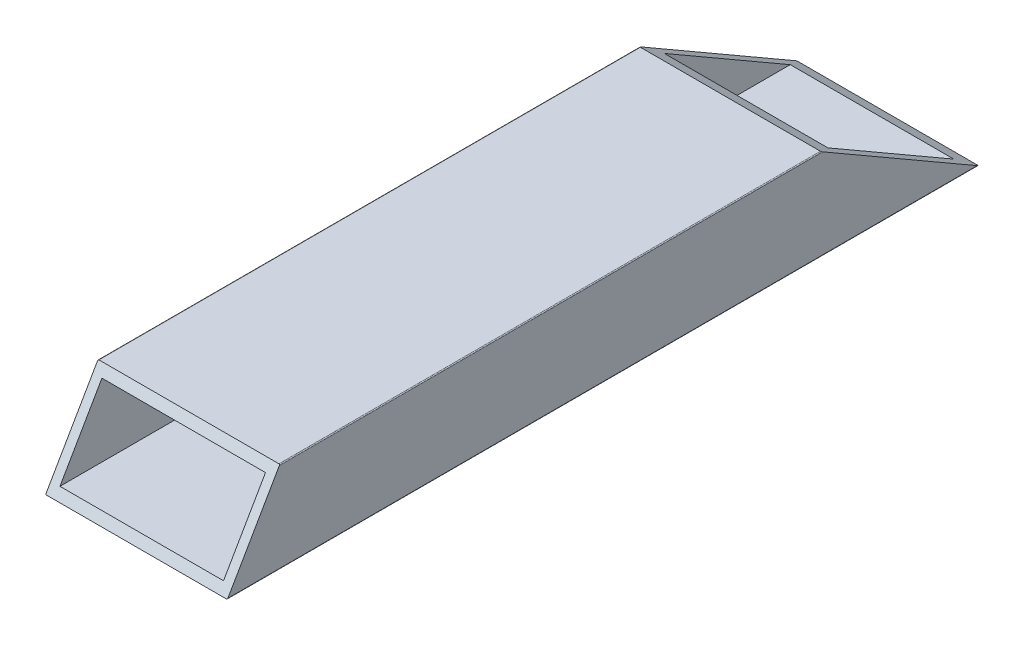
ISO-10303-21;
HEADER;
FILE_DESCRIPTION(('STEP AP214'),'2;1');
FILE_NAME('part.step','',(''),(''),'','','');
FILE_SCHEMA(('AUTOMOTIVE_DESIGN { 1 0 10303 214 1 1 1 1 }'));
ENDSEC;
DATA;
#1=APPLICATION_CONTEXT('core data for automotive mechanical design processes');
#2=APPLICATION_PROTOCOL_DEFINITION('international standard','automotive_design',2000,#1);
#3=PRODUCT_CONTEXT('',#1,'mechanical');
#4=PRODUCT('Part','Part','',(#3));
#5=PRODUCT_RELATED_PRODUCT_CATEGORY('part','',(#4));
#6=PRODUCT_DEFINITION_FORMATION('','',#4);
#7=PRODUCT_DEFINITION_CONTEXT('part definition',#1,'design');
#8=PRODUCT_DEFINITION('design','',#6,#7);
#9=PRODUCT_DEFINITION_SHAPE('','',#8);
#10=(LENGTH_UNIT() NAMED_UNIT(*) SI_UNIT(.MILLI.,.METRE.));
#11=(NAMED_UNIT(*) PLANE_ANGLE_UNIT() SI_UNIT($,.RADIAN.));
#12=(NAMED_UNIT(*) SI_UNIT($,.STERADIAN.) SOLID_ANGLE_UNIT());
#13=UNCERTAINTY_MEASURE_WITH_UNIT(LENGTH_MEASURE(1.E-05),#10,'distance_accuracy_value','');
#14=(GEOMETRIC_REPRESENTATION_CONTEXT(3) GLOBAL_UNCERTAINTY_ASSIGNED_CONTEXT((#13)) GLOBAL_UNIT_ASSIGNED_CONTEXT((#10,
#11,#12)) REPRESENTATION_CONTEXT('',''));
#15=CARTESIAN_POINT('',(0.,0.,0.));
#16=DIRECTION('',(0.,0.,1.));
#17=DIRECTION('',(1.,0.,0.));
#18=AXIS2_PLACEMENT_3D('',#15,#16,#17);
#19=CARTESIAN_POINT('',(2.,18.,165.35));
#20=DIRECTION('',(0.,-1.,0.));
#21=DIRECTION('',(0.,0.,-1.));
#22=AXIS2_PLACEMENT_3D('',#19,#20,#21);
#23=PLANE('',#22);
#24=DIRECTION('',(1.,0.,0.));
#25=VECTOR('',#24,1.);
#26=CARTESIAN_POINT('',(2.,18.,154.957695154587));
#27=LINE('',#26,#25);
#28=CARTESIAN_POINT('',(2.,18.,154.957695154587));
#29=VERTEX_POINT('',#28);
#30=CARTESIAN_POINT('',(38.,18.,154.957695154587));
#31=VERTEX_POINT('',#30);
#32=EDGE_CURVE('E11',#29,#31,#27,.T.);
#33=ORIENTED_EDGE('',*,*,#32,.F.);
#34=DIRECTION('',(0.,0.,-1.));
#35=VECTOR('',#34,1.);
#36=CARTESIAN_POINT('',(2.,18.,165.35));
#37=LINE('',#36,#35);
#38=CARTESIAN_POINT('',(2.,18.,31.1769145362402));
#39=VERTEX_POINT('',#38);
#40=EDGE_CURVE('E172',#29,#39,#37,.T.);
#41=ORIENTED_EDGE('',*,*,#40,.T.);
#42=DIRECTION('',(-1.,0.,0.));
#43=VECTOR('',#42,1.);
#44=CARTESIAN_POINT('',(1.99999999999992,18.,31.1769145362402));
#45=LINE('',#44,#43);
#46=CARTESIAN_POINT('',(38.,18.,31.1769145362402));
#47=VERTEX_POINT('',#46);
#48=EDGE_CURVE('E46',#47,#39,#45,.T.);
#49=ORIENTED_EDGE('',*,*,#48,.F.);
#50=DIRECTION('',(0.,0.,-1.));
#51=VECTOR('',#50,1.);
#52=CARTESIAN_POINT('',(38.,18.,165.35));
#53=LINE('',#52,#51);
#54=EDGE_CURVE('E178',#31,#47,#53,.T.);
#55=ORIENTED_EDGE('',*,*,#54,.F.);
#56=EDGE_LOOP('',(#33,#41,#49,#55));
#57=FACE_BOUND('',#56,.T.);
#58=ADVANCED_FACE('F38',(#57),#23,.T.);
#59=CARTESIAN_POINT('',(38.,2.,165.35));
#60=DIRECTION('',(-1.,0.,0.));
#61=DIRECTION('',(0.,0.,1.));
#62=AXIS2_PLACEMENT_3D('',#59,#60,#61);
#63=PLANE('',#62);
#64=DIRECTION('',(0.,-0.866025403784436,0.500000000000004));
#65=VECTOR('',#64,1.);
#66=CARTESIAN_POINT('',(38.,1.5,164.483974596216));
#67=LINE('',#66,#65);
#68=CARTESIAN_POINT('',(38.,2.,164.195299461621));
#69=VERTEX_POINT('',#68);
#70=EDGE_CURVE('E231',#31,#69,#67,.T.);
#71=ORIENTED_EDGE('',*,*,#70,.F.);
#72=ORIENTED_EDGE('',*,*,#54,.T.);
#73=DIRECTION('',(0.,0.499999999999995,0.866025403784442));
#74=VECTOR('',#73,1.);
#75=CARTESIAN_POINT('',(38.,72.098650257878,124.878525403785));
#76=LINE('',#75,#74);
#77=CARTESIAN_POINT('',(38.,2.,3.46410161513773));
#78=VERTEX_POINT('',#77);
#79=EDGE_CURVE('E162',#78,#47,#76,.T.);
#80=ORIENTED_EDGE('',*,*,#79,.F.);
#81=DIRECTION('',(0.,0.,-1.));
#82=VECTOR('',#81,1.);
#83=CARTESIAN_POINT('',(38.,2.,165.35));
#84=LINE('',#83,#82);
#85=EDGE_CURVE('E181',#69,#78,#84,.T.);
#86=ORIENTED_EDGE('',*,*,#85,.F.);
#87=EDGE_LOOP('',(#71,#72,#80,#86));
#88=FACE_BOUND('',#87,.T.);
#89=ADVANCED_FACE('F259',(#88),#63,.T.);
#90=CARTESIAN_POINT('',(2.,2.,165.35));
#91=DIRECTION('',(0.,1.,0.));
#92=DIRECTION('',(0.,0.,1.));
#93=AXIS2_PLACEMENT_3D('',#90,#91,#92);
#94=PLANE('',#93);
#95=DIRECTION('',(-1.,0.,0.));
#96=VECTOR('',#95,1.);
#97=CARTESIAN_POINT('',(2.,2.,164.195299461621));
#98=LINE('',#97,#96);
#99=CARTESIAN_POINT('',(2.,2.,164.195299461621));
#100=VERTEX_POINT('',#99);
#101=EDGE_CURVE('E233',#69,#100,#98,.T.);
#102=ORIENTED_EDGE('',*,*,#101,.F.);
#103=ORIENTED_EDGE('',*,*,#85,.T.);
#104=DIRECTION('',(1.,0.,0.));
#105=VECTOR('',#104,1.);
#106=CARTESIAN_POINT('',(1.9999999999999,2.,3.46410161513777));
#107=LINE('',#106,#105);
#108=CARTESIAN_POINT('',(2.,2.,3.46410161513777));
#109=VERTEX_POINT('',#108);
#110=EDGE_CURVE('E175',#109,#78,#107,.T.);
#111=ORIENTED_EDGE('',*,*,#110,.F.);
#112=DIRECTION('',(0.,0.,-1.));
#113=VECTOR('',#112,1.);
#114=CARTESIAN_POINT('',(2.,2.,165.35));
#115=LINE('',#114,#113);
#116=EDGE_CURVE('E145',#100,#109,#115,.T.);
#117=ORIENTED_EDGE('',*,*,#116,.F.);
#118=EDGE_LOOP('',(#102,#103,#111,#117));
#119=FACE_BOUND('',#118,.T.);
#120=ADVANCED_FACE('F264',(#119),#94,.T.);
#121=CARTESIAN_POINT('',(2.,2.,165.35));
#122=DIRECTION('',(1.,0.,0.));
#123=DIRECTION('',(0.,0.,-1.));
#124=AXIS2_PLACEMENT_3D('',#121,#122,#123);
#125=PLANE('',#124);
#126=DIRECTION('',(0.,0.866025403784436,-0.500000000000004));
#127=VECTOR('',#126,1.);
#128=CARTESIAN_POINT('',(2.,1.49999999999999,164.483974596216));
#129=LINE('',#128,#127);
#130=EDGE_CURVE('E235',#100,#29,#129,.T.);
#131=ORIENTED_EDGE('',*,*,#130,.F.);
#132=ORIENTED_EDGE('',*,*,#116,.T.);
#133=DIRECTION('',(0.,-0.499999999999995,-0.866025403784442));
#134=VECTOR('',#133,1.);
#135=CARTESIAN_POINT('',(2.,72.098650257878,124.878525403785));
#136=LINE('',#135,#134);
#137=EDGE_CURVE('E159',#39,#109,#136,.T.);
#138=ORIENTED_EDGE('',*,*,#137,.F.);
#139=ORIENTED_EDGE('',*,*,#40,.F.);
#140=EDGE_LOOP('',(#131,#132,#138,#139));
#141=FACE_BOUND('',#140,.T.);
#142=ADVANCED_FACE('F171',(#141),#125,.T.);
#143=CARTESIAN_POINT('',(40.,20.,34.641016151378));
#144=DIRECTION('',(0.,-0.866025403784442,0.499999999999995));
#145=DIRECTION('',(0.,-0.499999999999995,-0.866025403784442));
#146=AXIS2_PLACEMENT_3D('',#143,#144,#145);
#147=PLANE('',#146);
#148=ORIENTED_EDGE('',*,*,#137,.T.);
#149=ORIENTED_EDGE('',*,*,#110,.T.);
#150=ORIENTED_EDGE('',*,*,#79,.T.);
#151=ORIENTED_EDGE('',*,*,#48,.T.);
#152=EDGE_LOOP('',(#148,#149,#150,#151));
#153=FACE_BOUND('',#152,.T.);
#154=DIRECTION('',(0.,0.499999999999995,0.866025403784441));
#155=VECTOR('',#154,1.);
#156=CARTESIAN_POINT('',(0.,20.,34.641016151378));
#157=LINE('',#156,#155);
#158=CARTESIAN_POINT('',(0.,0.20000000000001,0.346410161513773));
#159=VERTEX_POINT('',#158);
#160=CARTESIAN_POINT('',(0.,19.8,34.2946059898642));
#161=VERTEX_POINT('',#160);
#162=EDGE_CURVE('E215',#159,#161,#157,.T.);
#163=ORIENTED_EDGE('',*,*,#162,.T.);
#164=CARTESIAN_POINT('',(0.2,19.8,34.2946059898642));
#165=DIRECTION('',(0.,-0.866025403784442,0.499999999999995));
#166=DIRECTION('',(0.,-0.499999999999995,-0.866025403784442));
#167=AXIS2_PLACEMENT_3D('',#164,#165,#166);
#168=ELLIPSE('',#167,0.400000000000003,0.199999999999999);
#169=CARTESIAN_POINT('',(0.199999999999999,20.,34.641016151378));
#170=VERTEX_POINT('',#169);
#171=EDGE_CURVE('E174',#170,#161,#168,.T.);
#172=ORIENTED_EDGE('',*,*,#171,.F.);
#173=DIRECTION('',(-1.,0.,0.));
#174=VECTOR('',#173,1.);
#175=CARTESIAN_POINT('',(40.,20.,34.641016151378));
#176=LINE('',#175,#174);
#177=CARTESIAN_POINT('',(39.8,20.,34.641016151378));
#178=VERTEX_POINT('',#177);
#179=EDGE_CURVE('E214',#178,#170,#176,.T.);
#180=ORIENTED_EDGE('',*,*,#179,.F.);
#181=CARTESIAN_POINT('',(39.8,19.8,34.2946059898642));
#182=DIRECTION('',(0.,-0.866025403784442,0.499999999999995));
#183=DIRECTION('',(0.,-0.499999999999995,-0.866025403784442));
#184=AXIS2_PLACEMENT_3D('',#181,#182,#183);
#185=ELLIPSE('',#184,0.400000000000001,0.199999999999999);
#186=CARTESIAN_POINT('',(40.,19.8,34.2946059898642));
#187=VERTEX_POINT('',#186);
#188=EDGE_CURVE('E134',#187,#178,#185,.T.);
#189=ORIENTED_EDGE('',*,*,#188,.F.);
#190=DIRECTION('',(0.,0.499999999999995,0.866025403784441));
#191=VECTOR('',#190,1.);
#192=CARTESIAN_POINT('',(40.,20.,34.641016151378));
#193=LINE('',#192,#191);
#194=CARTESIAN_POINT('',(40.,0.199999999999975,0.346410161513717));
#195=VERTEX_POINT('',#194);
#196=EDGE_CURVE('E129',#195,#187,#193,.T.);
#197=ORIENTED_EDGE('',*,*,#196,.F.);
#198=CARTESIAN_POINT('',(39.8,0.2,0.346410161513738));
#199=DIRECTION('',(0.,-0.866025403784442,0.499999999999995));
#200=DIRECTION('',(0.,-0.499999999999995,-0.866025403784442));
#201=AXIS2_PLACEMENT_3D('',#198,#199,#200);
#202=ELLIPSE('',#201,0.400000000000003,0.199999999999999);
#203=CARTESIAN_POINT('',(39.8,0.,0.));
#204=VERTEX_POINT('',#203);
#205=EDGE_CURVE('E124',#204,#195,#202,.T.);
#206=ORIENTED_EDGE('',*,*,#205,.F.);
#207=DIRECTION('',(1.,0.,0.));
#208=VECTOR('',#207,1.);
#209=CARTESIAN_POINT('',(0.200000000000001,0.,0.));
#210=LINE('',#209,#208);
#211=CARTESIAN_POINT('',(0.199999999999999,0.,0.));
#212=VERTEX_POINT('',#211);
#213=EDGE_CURVE('E127',#212,#204,#210,.T.);
#214=ORIENTED_EDGE('',*,*,#213,.F.);
#215=CARTESIAN_POINT('',(0.2,0.2,0.346410161513766));
#216=DIRECTION('',(0.,-0.866025403784442,0.499999999999995));
#217=DIRECTION('',(0.,-0.499999999999995,-0.866025403784442));
#218=AXIS2_PLACEMENT_3D('',#215,#216,#217);
#219=ELLIPSE('',#218,0.400000000000004,0.2);
#220=EDGE_CURVE('E61',#159,#212,#219,.T.);
#221=ORIENTED_EDGE('',*,*,#220,.F.);
#222=EDGE_LOOP('',(#163,#172,#180,#189,#197,#206,#214,#221));
#223=FACE_BOUND('',#222,.T.);
#224=ADVANCED_FACE('F126',(#153,#223),#147,.F.);
#225=CARTESIAN_POINT('',(40.,0.,165.35));
#226=DIRECTION('',(0.,-0.500000000000004,-0.866025403784436));
#227=DIRECTION('',(0.,0.866025403784436,-0.500000000000004));
#228=AXIS2_PLACEMENT_3D('',#225,#226,#227);
#229=PLANE('',#228);
#230=ORIENTED_EDGE('',*,*,#130,.T.);
#231=ORIENTED_EDGE('',*,*,#32,.T.);
#232=ORIENTED_EDGE('',*,*,#70,.T.);
#233=ORIENTED_EDGE('',*,*,#101,.T.);
#234=EDGE_LOOP('',(#230,#231,#232,#233));
#235=FACE_BOUND('',#234,.T.);
#236=DIRECTION('',(1.,0.,0.));
#237=VECTOR('',#236,1.);
#238=CARTESIAN_POINT('',(0.200000000000001,0.,165.35));
#239=LINE('',#238,#237);
#240=CARTESIAN_POINT('',(0.199999999999999,0.,165.35));
#241=VERTEX_POINT('',#240);
#242=CARTESIAN_POINT('',(39.8,0.,165.35));
#243=VERTEX_POINT('',#242);
#244=EDGE_CURVE('E144',#241,#243,#239,.T.);
#245=ORIENTED_EDGE('',*,*,#244,.T.);
#246=CARTESIAN_POINT('',(39.8,0.2,165.234529946162));
#247=DIRECTION('',(0.,-0.500000000000004,-0.866025403784436));
#248=DIRECTION('',(0.,0.866025403784436,-0.500000000000004));
#249=AXIS2_PLACEMENT_3D('',#246,#247,#248);
#250=ELLIPSE('',#249,0.23094010767585,0.199999999999999);
#251=CARTESIAN_POINT('',(40.,0.199999999999998,165.234529946162));
#252=VERTEX_POINT('',#251);
#253=EDGE_CURVE('E149',#252,#243,#250,.T.);
#254=ORIENTED_EDGE('',*,*,#253,.F.);
#255=DIRECTION('',(0.,-0.866025403784436,0.500000000000004));
#256=VECTOR('',#255,1.);
#257=CARTESIAN_POINT('',(40.,0.,165.35));
#258=LINE('',#257,#256);
#259=CARTESIAN_POINT('',(40.,19.8,153.918464670045));
#260=VERTEX_POINT('',#259);
#261=EDGE_CURVE('E213',#260,#252,#258,.T.);
#262=ORIENTED_EDGE('',*,*,#261,.F.);
#263=CARTESIAN_POINT('',(39.8,19.8,153.918464670045));
#264=DIRECTION('',(0.,-0.500000000000004,-0.866025403784436));
#265=DIRECTION('',(0.,0.866025403784436,-0.500000000000004));
#266=AXIS2_PLACEMENT_3D('',#263,#264,#265);
#267=ELLIPSE('',#266,0.230940107675849,0.199999999999999);
#268=CARTESIAN_POINT('',(39.8,20.,153.802994616207));
#269=VERTEX_POINT('',#268);
#270=EDGE_CURVE('E209',#269,#260,#267,.T.);
#271=ORIENTED_EDGE('',*,*,#270,.F.);
#272=DIRECTION('',(-1.,0.,0.));
#273=VECTOR('',#272,1.);
#274=CARTESIAN_POINT('',(40.,20.,153.802994616207));
#275=LINE('',#274,#273);
#276=CARTESIAN_POINT('',(0.199999999999999,20.,153.802994616207));
#277=VERTEX_POINT('',#276);
#278=EDGE_CURVE('E222',#269,#277,#275,.T.);
#279=ORIENTED_EDGE('',*,*,#278,.T.);
#280=CARTESIAN_POINT('',(0.2,19.8,153.918464670045));
#281=DIRECTION('',(0.,-0.500000000000004,-0.866025403784436));
#282=DIRECTION('',(0.,0.866025403784436,-0.500000000000004));
#283=AXIS2_PLACEMENT_3D('',#280,#281,#282);
#284=ELLIPSE('',#283,0.23094010767585,0.199999999999999);
#285=CARTESIAN_POINT('',(0.,19.8,153.918464670045));
#286=VERTEX_POINT('',#285);
#287=EDGE_CURVE('E53',#286,#277,#284,.T.);
#288=ORIENTED_EDGE('',*,*,#287,.F.);
#289=DIRECTION('',(0.,-0.866025403784436,0.500000000000004));
#290=VECTOR('',#289,1.);
#291=CARTESIAN_POINT('',(0.,0.,165.35));
#292=LINE('',#291,#290);
#293=CARTESIAN_POINT('',(0.,0.200000000000007,165.234529946162));
#294=VERTEX_POINT('',#293);
#295=EDGE_CURVE('E218',#286,#294,#292,.T.);
#296=ORIENTED_EDGE('',*,*,#295,.T.);
#297=CARTESIAN_POINT('',(0.2,0.2,165.234529946162));
#298=DIRECTION('',(0.,-0.500000000000004,-0.866025403784436));
#299=DIRECTION('',(0.,0.866025403784436,-0.500000000000004));
#300=AXIS2_PLACEMENT_3D('',#297,#298,#299);
#301=ELLIPSE('',#300,0.230940107675851,0.2);
#302=EDGE_CURVE('E179',#241,#294,#301,.T.);
#303=ORIENTED_EDGE('',*,*,#302,.F.);
#304=EDGE_LOOP('',(#245,#254,#262,#271,#279,#288,#296,#303));
#305=FACE_BOUND('',#304,.T.);
#306=ADVANCED_FACE('F249',(#235,#305),#229,.F.);
#307=CARTESIAN_POINT('',(0.2,0.2,165.35));
#308=DIRECTION('',(0.,0.,-1.));
#309=DIRECTION('',(-1.,0.,0.));
#310=AXIS2_PLACEMENT_3D('',#307,#308,#309);
#311=CYLINDRICAL_SURFACE('',#310,0.2);
#312=DIRECTION('',(0.,0.,-1.));
#313=VECTOR('',#312,1.);
#314=CARTESIAN_POINT('',(0.200000000000001,0.,165.35));
#315=LINE('',#314,#313);
#316=EDGE_CURVE('E143',#241,#212,#315,.T.);
#317=ORIENTED_EDGE('',*,*,#316,.F.);
#318=ORIENTED_EDGE('',*,*,#302,.T.);
#319=DIRECTION('',(0.,0.,-1.));
#320=VECTOR('',#319,1.);
#321=CARTESIAN_POINT('',(0.,0.200000000000001,165.35));
#322=LINE('',#321,#320);
#323=EDGE_CURVE('E190',#294,#159,#322,.T.);
#324=ORIENTED_EDGE('',*,*,#323,.T.);
#325=ORIENTED_EDGE('',*,*,#220,.T.);
#326=EDGE_LOOP('',(#317,#318,#324,#325));
#327=FACE_BOUND('',#326,.T.);
#328=ADVANCED_FACE('F40',(#327),#311,.T.);
#329=CARTESIAN_POINT('',(0.200000000000001,0.,165.35));
#330=DIRECTION('',(0.,1.,0.));
#331=DIRECTION('',(0.,0.,1.));
#332=AXIS2_PLACEMENT_3D('',#329,#330,#331);
#333=PLANE('',#332);
#334=ORIENTED_EDGE('',*,*,#213,.T.);
#335=DIRECTION('',(0.,0.,-1.));
#336=VECTOR('',#335,1.);
#337=CARTESIAN_POINT('',(39.8,0.,165.35));
#338=LINE('',#337,#336);
#339=EDGE_CURVE('E141',#243,#204,#338,.T.);
#340=ORIENTED_EDGE('',*,*,#339,.F.);
#341=ORIENTED_EDGE('',*,*,#244,.F.);
#342=ORIENTED_EDGE('',*,*,#316,.T.);
#343=EDGE_LOOP('',(#334,#340,#341,#342));
#344=FACE_BOUND('',#343,.T.);
#345=ADVANCED_FACE('F139',(#344),#333,.F.);
#346=CARTESIAN_POINT('',(39.8,0.2,165.35));
#347=DIRECTION('',(0.,0.,-1.));
#348=DIRECTION('',(-1.,0.,0.));
#349=AXIS2_PLACEMENT_3D('',#346,#347,#348);
#350=CYLINDRICAL_SURFACE('',#349,0.199999999999999);
#351=DIRECTION('',(0.,0.,-1.));
#352=VECTOR('',#351,1.);
#353=CARTESIAN_POINT('',(40.,0.2,165.35));
#354=LINE('',#353,#352);
#355=EDGE_CURVE('E150',#252,#195,#354,.T.);
#356=ORIENTED_EDGE('',*,*,#355,.F.);
#357=ORIENTED_EDGE('',*,*,#253,.T.);
#358=ORIENTED_EDGE('',*,*,#339,.T.);
#359=ORIENTED_EDGE('',*,*,#205,.T.);
#360=EDGE_LOOP('',(#356,#357,#358,#359));
#361=FACE_BOUND('',#360,.T.);
#362=ADVANCED_FACE('F148',(#361),#350,.T.);
#363=CARTESIAN_POINT('',(40.,0.2,165.35));
#364=DIRECTION('',(-1.,0.,0.));
#365=DIRECTION('',(0.,-1.,0.));
#366=AXIS2_PLACEMENT_3D('',#363,#364,#365);
#367=PLANE('',#366);
#368=DIRECTION('',(0.,0.,-1.));
#369=VECTOR('',#368,1.);
#370=CARTESIAN_POINT('',(40.,19.8,165.35));
#371=LINE('',#370,#369);
#372=EDGE_CURVE('E153',#260,#187,#371,.T.);
#373=ORIENTED_EDGE('',*,*,#372,.F.);
#374=ORIENTED_EDGE('',*,*,#261,.T.);
#375=ORIENTED_EDGE('',*,*,#355,.T.);
#376=ORIENTED_EDGE('',*,*,#196,.T.);
#377=EDGE_LOOP('',(#373,#374,#375,#376));
#378=FACE_BOUND('',#377,.T.);
#379=ADVANCED_FACE('F212',(#378),#367,.F.);
#380=CARTESIAN_POINT('',(39.8,19.8,165.35));
#381=DIRECTION('',(0.,0.,-1.));
#382=DIRECTION('',(-1.,0.,0.));
#383=AXIS2_PLACEMENT_3D('',#380,#381,#382);
#384=CYLINDRICAL_SURFACE('',#383,0.199999999999999);
#385=DIRECTION('',(0.,0.,-1.));
#386=VECTOR('',#385,1.);
#387=CARTESIAN_POINT('',(39.8,20.,165.35));
#388=LINE('',#387,#386);
#389=EDGE_CURVE('E200',#269,#178,#388,.T.);
#390=ORIENTED_EDGE('',*,*,#389,.F.);
#391=ORIENTED_EDGE('',*,*,#270,.T.);
#392=ORIENTED_EDGE('',*,*,#372,.T.);
#393=ORIENTED_EDGE('',*,*,#188,.T.);
#394=EDGE_LOOP('',(#390,#391,#392,#393));
#395=FACE_BOUND('',#394,.T.);
#396=ADVANCED_FACE('F208',(#395),#384,.T.);
#397=CARTESIAN_POINT('',(0.2,20.,165.35));
#398=DIRECTION('',(0.,-1.,0.));
#399=DIRECTION('',(0.,0.,-1.));
#400=AXIS2_PLACEMENT_3D('',#397,#398,#399);
#401=PLANE('',#400);
#402=DIRECTION('',(0.,0.,-1.));
#403=VECTOR('',#402,1.);
#404=CARTESIAN_POINT('',(0.2,20.,165.35));
#405=LINE('',#404,#403);
#406=EDGE_CURVE('E197',#277,#170,#405,.T.);
#407=ORIENTED_EDGE('',*,*,#406,.F.);
#408=ORIENTED_EDGE('',*,*,#278,.F.);
#409=ORIENTED_EDGE('',*,*,#389,.T.);
#410=ORIENTED_EDGE('',*,*,#179,.T.);
#411=EDGE_LOOP('',(#407,#408,#409,#410));
#412=FACE_BOUND('',#411,.T.);
#413=ADVANCED_FACE('F244',(#412),#401,.F.);
#414=CARTESIAN_POINT('',(0.2,19.8,165.35));
#415=DIRECTION('',(0.,0.,-1.));
#416=DIRECTION('',(-1.,0.,0.));
#417=AXIS2_PLACEMENT_3D('',#414,#415,#416);
#418=CYLINDRICAL_SURFACE('',#417,0.199999999999999);
#419=DIRECTION('',(0.,0.,-1.));
#420=VECTOR('',#419,1.);
#421=CARTESIAN_POINT('',(0.,19.8,165.35));
#422=LINE('',#421,#420);
#423=EDGE_CURVE('E194',#286,#161,#422,.T.);
#424=ORIENTED_EDGE('',*,*,#423,.F.);
#425=ORIENTED_EDGE('',*,*,#287,.T.);
#426=ORIENTED_EDGE('',*,*,#406,.T.);
#427=ORIENTED_EDGE('',*,*,#171,.T.);
#428=EDGE_LOOP('',(#424,#425,#426,#427));
#429=FACE_BOUND('',#428,.T.);
#430=ADVANCED_FACE('F241',(#429),#418,.T.);
#431=CARTESIAN_POINT('',(0.,0.200000000000001,165.35));
#432=DIRECTION('',(1.,0.,0.));
#433=DIRECTION('',(0.,1.,0.));
#434=AXIS2_PLACEMENT_3D('',#431,#432,#433);
#435=PLANE('',#434);
#436=ORIENTED_EDGE('',*,*,#323,.F.);
#437=ORIENTED_EDGE('',*,*,#295,.F.);
#438=ORIENTED_EDGE('',*,*,#423,.T.);
#439=ORIENTED_EDGE('',*,*,#162,.F.);
#440=EDGE_LOOP('',(#436,#437,#438,#439));
#441=FACE_BOUND('',#440,.T.);
#442=ADVANCED_FACE('F247',(#441),#435,.F.);
#443=CLOSED_SHELL('',(#58,#89,#120,#142,#224,#306,#328,#345,#362,#379,#396,#413,#430,#442));
#444=MANIFOLD_SOLID_BREP('B2',#443);
#445=ADVANCED_BREP_SHAPE_REPRESENTATION('',(#18,#444),#14);
#446=SHAPE_DEFINITION_REPRESENTATION(#9,#445);
ENDSEC;
END-ISO-10303-21;
